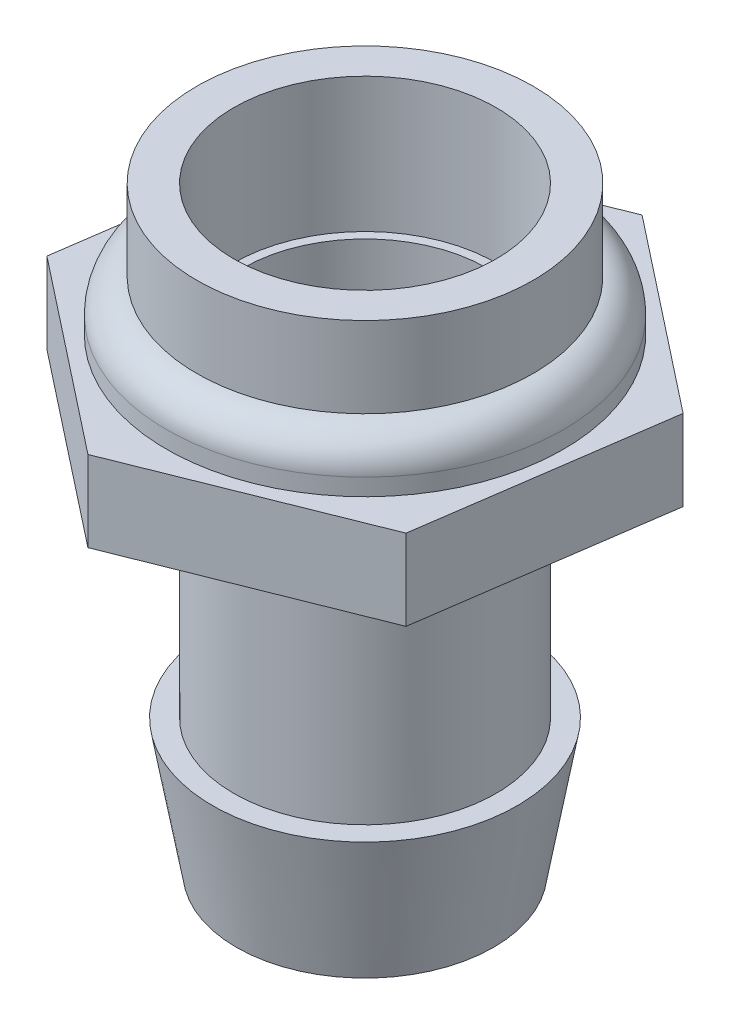
ISO-10303-21;
HEADER;
FILE_DESCRIPTION(('STEP AP214'),'2;1');
FILE_NAME('part.step','',(''),(''),'','','');
FILE_SCHEMA(('AUTOMOTIVE_DESIGN { 1 0 10303 214 1 1 1 1 }'));
ENDSEC;
DATA;
#1=APPLICATION_CONTEXT('core data for automotive mechanical design processes');
#2=APPLICATION_PROTOCOL_DEFINITION('international standard','automotive_design',2000,#1);
#3=PRODUCT_CONTEXT('',#1,'mechanical');
#4=PRODUCT('Part','Part','',(#3));
#5=PRODUCT_RELATED_PRODUCT_CATEGORY('part','',(#4));
#6=PRODUCT_DEFINITION_FORMATION('','',#4);
#7=PRODUCT_DEFINITION_CONTEXT('part definition',#1,'design');
#8=PRODUCT_DEFINITION('design','',#6,#7);
#9=PRODUCT_DEFINITION_SHAPE('','',#8);
#10=(LENGTH_UNIT() NAMED_UNIT(*) SI_UNIT(.MILLI.,.METRE.));
#11=(NAMED_UNIT(*) PLANE_ANGLE_UNIT() SI_UNIT($,.RADIAN.));
#12=(NAMED_UNIT(*) SI_UNIT($,.STERADIAN.) SOLID_ANGLE_UNIT());
#13=UNCERTAINTY_MEASURE_WITH_UNIT(LENGTH_MEASURE(1.E-05),#10,'distance_accuracy_value','');
#14=(GEOMETRIC_REPRESENTATION_CONTEXT(3) GLOBAL_UNCERTAINTY_ASSIGNED_CONTEXT((#13)) GLOBAL_UNIT_ASSIGNED_CONTEXT((#10,
#11,#12)) REPRESENTATION_CONTEXT('',''));
#15=CARTESIAN_POINT('',(0.,0.,0.));
#16=DIRECTION('',(0.,0.,1.));
#17=DIRECTION('',(1.,0.,0.));
#18=AXIS2_PLACEMENT_3D('',#15,#16,#17);
#19=CARTESIAN_POINT('',(-38.0150992469953,8.001,-9.73674048361836));
#20=DIRECTION('',(0.,-1.,0.));
#21=DIRECTION('',(0.,0.,-1.));
#22=AXIS2_PLACEMENT_3D('',#19,#20,#21);
#23=CYLINDRICAL_SURFACE('',#22,4.6101);
#24=CARTESIAN_POINT('',(-38.0150992469953,-14.5542,-9.73674048361836));
#25=DIRECTION('',(0.,-1.,0.));
#26=DIRECTION('',(0.,0.,-1.));
#27=AXIS2_PLACEMENT_3D('',#24,#25,#26);
#28=CIRCLE('',#27,4.6101);
#29=CARTESIAN_POINT('',(-38.0150992469953,-14.5542,-14.3468404836184));
#30=VERTEX_POINT('',#29);
#31=EDGE_CURVE('E397',#30,#30,#28,.T.);
#32=ORIENTED_EDGE('',*,*,#31,.T.);
#33=EDGE_LOOP('',(#32));
#34=FACE_BOUND('',#33,.T.);
#35=CARTESIAN_POINT('',(-38.0150992469953,2.921,-9.73674048361836));
#36=DIRECTION('',(0.,1.,0.));
#37=DIRECTION('',(0.,0.,1.));
#38=AXIS2_PLACEMENT_3D('',#35,#36,#37);
#39=CIRCLE('',#38,4.6101);
#40=CARTESIAN_POINT('',(-38.0150992469953,2.921,-5.12664048361836));
#41=VERTEX_POINT('',#40);
#42=EDGE_CURVE('E40',#41,#41,#39,.F.);
#43=ORIENTED_EDGE('',*,*,#42,.F.);
#44=EDGE_LOOP('',(#43));
#45=FACE_BOUND('',#44,.T.);
#46=ADVANCED_FACE('F36',(#34,#45),#23,.F.);
#47=CARTESIAN_POINT('',(-39.3313691840741,3.048,-0.592228388774663));
#48=DIRECTION('',(-0.371514490296866,0.,-0.92842715573138));
#49=DIRECTION('',(-0.92842715573138,0.,0.371514490296866));
#50=AXIS2_PLACEMENT_3D('',#47,#48,#49);
#51=PLANE('',#50);
#52=DIRECTION('',(0.92842715573138,0.,-0.371514490296866));
#53=VECTOR('',#52,1.);
#54=CARTESIAN_POINT('',(-39.3313691840741,0.,-0.592228388774663));
#55=LINE('',#54,#53);
#56=CARTESIAN_POINT('',(-39.3313691840741,0.,-0.592228388774663));
#57=VERTEX_POINT('',#56);
#58=CARTESIAN_POINT('',(-30.753854436186,0.,-4.02456123244849));
#59=VERTEX_POINT('',#58);
#60=EDGE_CURVE('E123',#57,#59,#55,.T.);
#61=ORIENTED_EDGE('',*,*,#60,.T.);
#62=DIRECTION('',(0.,-1.,0.));
#63=VECTOR('',#62,1.);
#64=CARTESIAN_POINT('',(-30.753854436186,3.048,-4.02456123244849));
#65=LINE('',#64,#63);
#66=CARTESIAN_POINT('',(-30.753854436186,3.048,-4.02456123244849));
#67=VERTEX_POINT('',#66);
#68=EDGE_CURVE('E141',#67,#59,#65,.T.);
#69=ORIENTED_EDGE('',*,*,#68,.F.);
#70=DIRECTION('',(0.92842715573138,0.,-0.371514490296866));
#71=VECTOR('',#70,1.);
#72=CARTESIAN_POINT('',(-39.3313691840741,3.048,-0.592228388774663));
#73=LINE('',#72,#71);
#74=CARTESIAN_POINT('',(-39.3313691840741,3.048,-0.592228388774663));
#75=VERTEX_POINT('',#74);
#76=EDGE_CURVE('E134',#75,#67,#73,.T.);
#77=ORIENTED_EDGE('',*,*,#76,.F.);
#78=DIRECTION('',(0.,-1.,0.));
#79=VECTOR('',#78,1.);
#80=CARTESIAN_POINT('',(-39.3313691840741,3.048,-0.592228388774663));
#81=LINE('',#80,#79);
#82=EDGE_CURVE('E119',#75,#57,#81,.T.);
#83=ORIENTED_EDGE('',*,*,#82,.T.);
#84=EDGE_LOOP('',(#61,#69,#77,#83));
#85=FACE_BOUND('',#84,.T.);
#86=ADVANCED_FACE('F157',(#85),#51,.F.);
#87=CARTESIAN_POINT('',(-30.753854436186,3.048,-4.02456123244849));
#88=DIRECTION('',(-0.989798747575139,0.,-0.142472591394578));
#89=DIRECTION('',(-0.142472591394578,0.,0.989798747575139));
#90=AXIS2_PLACEMENT_3D('',#87,#88,#89);
#91=PLANE('',#90);
#92=DIRECTION('',(0.142472591394578,0.,-0.989798747575139));
#93=VECTOR('',#92,1.);
#94=CARTESIAN_POINT('',(-30.753854436186,0.,-4.02456123244849));
#95=LINE('',#94,#93);
#96=CARTESIAN_POINT('',(-29.4375844991072,0.,-13.1690733272922));
#97=VERTEX_POINT('',#96);
#98=EDGE_CURVE('E126',#59,#97,#95,.T.);
#99=ORIENTED_EDGE('',*,*,#98,.T.);
#100=DIRECTION('',(0.,-1.,0.));
#101=VECTOR('',#100,1.);
#102=CARTESIAN_POINT('',(-29.4375844991072,3.048,-13.1690733272922));
#103=LINE('',#102,#101);
#104=CARTESIAN_POINT('',(-29.4375844991072,3.048,-13.1690733272922));
#105=VERTEX_POINT('',#104);
#106=EDGE_CURVE('E138',#105,#97,#103,.T.);
#107=ORIENTED_EDGE('',*,*,#106,.F.);
#108=DIRECTION('',(0.142472591394578,0.,-0.989798747575139));
#109=VECTOR('',#108,1.);
#110=CARTESIAN_POINT('',(-30.753854436186,3.048,-4.02456123244849));
#111=LINE('',#110,#109);
#112=EDGE_CURVE('E92',#67,#105,#111,.T.);
#113=ORIENTED_EDGE('',*,*,#112,.F.);
#114=ORIENTED_EDGE('',*,*,#68,.T.);
#115=EDGE_LOOP('',(#99,#107,#113,#114));
#116=FACE_BOUND('',#115,.T.);
#117=ADVANCED_FACE('F175',(#116),#91,.F.);
#118=CARTESIAN_POINT('',(-29.4375844991072,3.048,-13.1690733272922));
#119=DIRECTION('',(-0.618284257278274,0.,0.785954564336803));
#120=DIRECTION('',(0.785954564336803,0.,0.618284257278274));
#121=AXIS2_PLACEMENT_3D('',#118,#119,#120);
#122=PLANE('',#121);
#123=DIRECTION('',(-0.785954564336803,0.,-0.618284257278274));
#124=VECTOR('',#123,1.);
#125=CARTESIAN_POINT('',(-29.4375844991072,0.,-13.1690733272922));
#126=LINE('',#125,#124);
#127=CARTESIAN_POINT('',(-36.6988293099165,0.,-18.881252578462));
#128=VERTEX_POINT('',#127);
#129=EDGE_CURVE('E129',#97,#128,#126,.T.);
#130=ORIENTED_EDGE('',*,*,#129,.T.);
#131=DIRECTION('',(0.,-1.,0.));
#132=VECTOR('',#131,1.);
#133=CARTESIAN_POINT('',(-36.6988293099165,3.048,-18.881252578462));
#134=LINE('',#133,#132);
#135=CARTESIAN_POINT('',(-36.6988293099165,3.048,-18.881252578462));
#136=VERTEX_POINT('',#135);
#137=EDGE_CURVE('E114',#136,#128,#134,.T.);
#138=ORIENTED_EDGE('',*,*,#137,.F.);
#139=DIRECTION('',(-0.785954564336803,0.,-0.618284257278274));
#140=VECTOR('',#139,1.);
#141=CARTESIAN_POINT('',(-29.4375844991072,3.048,-13.1690733272922));
#142=LINE('',#141,#140);
#143=EDGE_CURVE('E105',#105,#136,#142,.T.);
#144=ORIENTED_EDGE('',*,*,#143,.F.);
#145=ORIENTED_EDGE('',*,*,#106,.T.);
#146=EDGE_LOOP('',(#130,#138,#144,#145));
#147=FACE_BOUND('',#146,.T.);
#148=ADVANCED_FACE('F222',(#147),#122,.F.);
#149=CARTESIAN_POINT('',(-36.6988293099165,3.048,-18.881252578462));
#150=DIRECTION('',(0.371514490296865,0.,0.92842715573138));
#151=DIRECTION('',(0.92842715573138,0.,-0.371514490296866));
#152=AXIS2_PLACEMENT_3D('',#149,#150,#151);
#153=PLANE('',#152);
#154=DIRECTION('',(-0.92842715573138,0.,0.371514490296865));
#155=VECTOR('',#154,1.);
#156=CARTESIAN_POINT('',(-36.6988293099165,0.,-18.881252578462));
#157=LINE('',#156,#155);
#158=CARTESIAN_POINT('',(-45.2763440578046,0.,-15.4489197347882));
#159=VERTEX_POINT('',#158);
#160=EDGE_CURVE('E113',#128,#159,#157,.T.);
#161=ORIENTED_EDGE('',*,*,#160,.T.);
#162=DIRECTION('',(0.,-1.,0.));
#163=VECTOR('',#162,1.);
#164=CARTESIAN_POINT('',(-45.2763440578046,3.048,-15.4489197347882));
#165=LINE('',#164,#163);
#166=CARTESIAN_POINT('',(-45.2763440578046,3.048,-15.4489197347882));
#167=VERTEX_POINT('',#166);
#168=EDGE_CURVE('E110',#167,#159,#165,.T.);
#169=ORIENTED_EDGE('',*,*,#168,.F.);
#170=DIRECTION('',(-0.92842715573138,0.,0.371514490296865));
#171=VECTOR('',#170,1.);
#172=CARTESIAN_POINT('',(-36.6988293099165,3.048,-18.881252578462));
#173=LINE('',#172,#171);
#174=EDGE_CURVE('E99',#136,#167,#173,.T.);
#175=ORIENTED_EDGE('',*,*,#174,.F.);
#176=ORIENTED_EDGE('',*,*,#137,.T.);
#177=EDGE_LOOP('',(#161,#169,#175,#176));
#178=FACE_BOUND('',#177,.T.);
#179=ADVANCED_FACE('F111',(#178),#153,.F.);
#180=CARTESIAN_POINT('',(-45.2763440578046,3.048,-15.4489197347882));
#181=DIRECTION('',(0.989798747575139,0.,0.142472591394577));
#182=DIRECTION('',(0.142472591394577,0.,-0.989798747575139));
#183=AXIS2_PLACEMENT_3D('',#180,#181,#182);
#184=PLANE('',#183);
#185=DIRECTION('',(-0.142472591394577,0.,0.989798747575139));
#186=VECTOR('',#185,1.);
#187=CARTESIAN_POINT('',(-45.2763440578046,0.,-15.4489197347882));
#188=LINE('',#187,#186);
#189=CARTESIAN_POINT('',(-46.5926139948834,0.,-6.30440763994452));
#190=VERTEX_POINT('',#189);
#191=EDGE_CURVE('E77',#159,#190,#188,.T.);
#192=ORIENTED_EDGE('',*,*,#191,.T.);
#193=DIRECTION('',(0.,-1.,0.));
#194=VECTOR('',#193,1.);
#195=CARTESIAN_POINT('',(-46.5926139948834,3.048,-6.30440763994452));
#196=LINE('',#195,#194);
#197=CARTESIAN_POINT('',(-46.5926139948834,3.048,-6.30440763994452));
#198=VERTEX_POINT('',#197);
#199=EDGE_CURVE('E115',#198,#190,#196,.T.);
#200=ORIENTED_EDGE('',*,*,#199,.F.);
#201=DIRECTION('',(-0.142472591394577,0.,0.989798747575139));
#202=VECTOR('',#201,1.);
#203=CARTESIAN_POINT('',(-45.2763440578046,3.048,-15.4489197347882));
#204=LINE('',#203,#202);
#205=EDGE_CURVE('E103',#167,#198,#204,.T.);
#206=ORIENTED_EDGE('',*,*,#205,.F.);
#207=ORIENTED_EDGE('',*,*,#168,.T.);
#208=EDGE_LOOP('',(#192,#200,#206,#207));
#209=FACE_BOUND('',#208,.T.);
#210=ADVANCED_FACE('F117',(#209),#184,.F.);
#211=CARTESIAN_POINT('',(-46.5926139948834,3.048,-6.30440763994452));
#212=DIRECTION('',(0.618284257278274,0.,-0.785954564336802));
#213=DIRECTION('',(-0.785954564336802,0.,-0.618284257278274));
#214=AXIS2_PLACEMENT_3D('',#211,#212,#213);
#215=PLANE('',#214);
#216=DIRECTION('',(0.785954564336802,0.,0.618284257278274));
#217=VECTOR('',#216,1.);
#218=CARTESIAN_POINT('',(-46.5926139948834,0.,-6.30440763994452));
#219=LINE('',#218,#217);
#220=EDGE_CURVE('E83',#190,#57,#219,.T.);
#221=ORIENTED_EDGE('',*,*,#220,.T.);
#222=ORIENTED_EDGE('',*,*,#82,.F.);
#223=DIRECTION('',(0.785954564336802,0.,0.618284257278274));
#224=VECTOR('',#223,1.);
#225=CARTESIAN_POINT('',(-46.5926139948834,3.048,-6.30440763994452));
#226=LINE('',#225,#224);
#227=EDGE_CURVE('E54',#198,#75,#226,.T.);
#228=ORIENTED_EDGE('',*,*,#227,.F.);
#229=ORIENTED_EDGE('',*,*,#199,.T.);
#230=EDGE_LOOP('',(#221,#222,#228,#229));
#231=FACE_BOUND('',#230,.T.);
#232=ADVANCED_FACE('F159',(#231),#215,.F.);
#233=CARTESIAN_POINT('',(0.,3.048,0.));
#234=DIRECTION('',(0.,1.,0.));
#235=DIRECTION('',(0.,0.,1.));
#236=AXIS2_PLACEMENT_3D('',#233,#234,#235);
#237=PLANE('',#236);
#238=CARTESIAN_POINT('',(-38.0150992469953,3.048,-9.73674048361835));
#239=DIRECTION('',(0.,1.,0.));
#240=DIRECTION('',(0.,0.,1.));
#241=AXIS2_PLACEMENT_3D('',#238,#239,#240);
#242=CIRCLE('',#241,7.493);
#243=CARTESIAN_POINT('',(-38.0150992469953,3.048,-17.2297404836184));
#244=VERTEX_POINT('',#243);
#245=EDGE_CURVE('E127',#244,#244,#242,.T.);
#246=ORIENTED_EDGE('',*,*,#245,.F.);
#247=EDGE_LOOP('',(#246));
#248=FACE_BOUND('',#247,.T.);
#249=ORIENTED_EDGE('',*,*,#76,.T.);
#250=ORIENTED_EDGE('',*,*,#112,.T.);
#251=ORIENTED_EDGE('',*,*,#143,.T.);
#252=ORIENTED_EDGE('',*,*,#174,.T.);
#253=ORIENTED_EDGE('',*,*,#205,.T.);
#254=ORIENTED_EDGE('',*,*,#227,.T.);
#255=EDGE_LOOP('',(#249,#250,#251,#252,#253,#254));
#256=FACE_BOUND('',#255,.T.);
#257=ADVANCED_FACE('F101',(#248,#256),#237,.T.);
#258=CARTESIAN_POINT('',(0.,0.,0.));
#259=DIRECTION('',(0.,1.,0.));
#260=DIRECTION('',(0.,0.,1.));
#261=AXIS2_PLACEMENT_3D('',#258,#259,#260);
#262=PLANE('',#261);
#263=CARTESIAN_POINT('',(-38.0150992469953,0.,-9.73674048361836));
#264=DIRECTION('',(0.,1.,0.));
#265=DIRECTION('',(0.,0.,1.));
#266=AXIS2_PLACEMENT_3D('',#263,#264,#265);
#267=CIRCLE('',#266,4.953);
#268=CARTESIAN_POINT('',(-38.0150992469953,0.,-4.78374048361836));
#269=VERTEX_POINT('',#268);
#270=EDGE_CURVE('E46',#269,#269,#267,.F.);
#271=ORIENTED_EDGE('',*,*,#270,.F.);
#272=EDGE_LOOP('',(#271));
#273=FACE_BOUND('',#272,.T.);
#274=ORIENTED_EDGE('',*,*,#60,.F.);
#275=ORIENTED_EDGE('',*,*,#220,.F.);
#276=ORIENTED_EDGE('',*,*,#191,.F.);
#277=ORIENTED_EDGE('',*,*,#160,.F.);
#278=ORIENTED_EDGE('',*,*,#129,.F.);
#279=ORIENTED_EDGE('',*,*,#98,.F.);
#280=EDGE_LOOP('',(#274,#275,#276,#277,#278,#279));
#281=FACE_BOUND('',#280,.T.);
#282=ADVANCED_FACE('F148',(#273,#281),#262,.F.);
#283=CARTESIAN_POINT('',(-38.0150992469953,4.953,-9.73674048361835));
#284=DIRECTION('',(0.,-1.,0.));
#285=DIRECTION('',(0.,0.,-1.));
#286=AXIS2_PLACEMENT_3D('',#283,#284,#285);
#287=CYLINDRICAL_SURFACE('',#286,7.493);
#288=CARTESIAN_POINT('',(-38.0150992469953,3.68936595487459,-9.73674048361835));
#289=DIRECTION('',(0.,1.,0.));
#290=DIRECTION('',(0.,0.,1.));
#291=AXIS2_PLACEMENT_3D('',#288,#289,#290);
#292=CIRCLE('',#291,7.493);
#293=CARTESIAN_POINT('',(-38.0150992469953,3.68936595487459,-17.2297404836184));
#294=VERTEX_POINT('',#293);
#295=EDGE_CURVE('E11',#294,#294,#292,.F.);
#296=CARTESIAN_POINT('',(-38.0150992469953,3.68936595487459,-17.2297404836184));
#297=CARTESIAN_POINT('',(-38.0150992469953,3.68268505951132,-17.2297404836184));
#298=CARTESIAN_POINT('',(-38.0150992469953,3.67600416414804,-17.2297404836184));
#299=CARTESIAN_POINT('',(-38.0150992469953,3.66264237342148,-17.2297404836184));
#300=CARTESIAN_POINT('',(-38.0150992469953,3.65596147805821,-17.2297404836184));
#301=CARTESIAN_POINT('',(-38.0150992469953,3.64259968733165,-17.2297404836184));
#302=CARTESIAN_POINT('',(-38.0150992469953,3.63591879196838,-17.2297404836184));
#303=CARTESIAN_POINT('',(-38.0150992469953,3.62255700124182,-17.2297404836184));
#304=CARTESIAN_POINT('',(-38.0150992469953,3.61587610587855,-17.2297404836184));
#305=CARTESIAN_POINT('',(-38.0150992469953,3.60251431515199,-17.2297404836184));
#306=CARTESIAN_POINT('',(-38.0150992469953,3.59583341978871,-17.2297404836184));
#307=CARTESIAN_POINT('',(-38.0150992469953,3.58247162906216,-17.2297404836184));
#308=CARTESIAN_POINT('',(-38.0150992469953,3.57579073369888,-17.2297404836184));
#309=CARTESIAN_POINT('',(-38.0150992469953,3.56242894297233,-17.2297404836184));
#310=CARTESIAN_POINT('',(-38.0150992469953,3.55574804760905,-17.2297404836184));
#311=CARTESIAN_POINT('',(-38.0150992469953,3.5423862568825,-17.2297404836184));
#312=CARTESIAN_POINT('',(-38.0150992469953,3.53570536151922,-17.2297404836184));
#313=CARTESIAN_POINT('',(-38.0150992469953,3.52234357079267,-17.2297404836184));
#314=CARTESIAN_POINT('',(-38.0150992469953,3.51566267542939,-17.2297404836184));
#315=CARTESIAN_POINT('',(-38.0150992469953,3.50230088470284,-17.2297404836184));
#316=CARTESIAN_POINT('',(-38.0150992469953,3.49561998933956,-17.2297404836184));
#317=CARTESIAN_POINT('',(-38.0150992469953,3.48225819861301,-17.2297404836184));
#318=CARTESIAN_POINT('',(-38.0150992469953,3.47557730324973,-17.2297404836184));
#319=CARTESIAN_POINT('',(-38.0150992469953,3.46221551252317,-17.2297404836184));
#320=CARTESIAN_POINT('',(-38.0150992469953,3.4555346171599,-17.2297404836184));
#321=CARTESIAN_POINT('',(-38.0150992469953,3.44217282643334,-17.2297404836184));
#322=CARTESIAN_POINT('',(-38.0150992469953,3.43549193107007,-17.2297404836184));
#323=CARTESIAN_POINT('',(-38.0150992469953,3.42213014034351,-17.2297404836184));
#324=CARTESIAN_POINT('',(-38.0150992469953,3.41544924498024,-17.2297404836184));
#325=CARTESIAN_POINT('',(-38.0150992469953,3.40208745425368,-17.2297404836184));
#326=CARTESIAN_POINT('',(-38.0150992469953,3.3954065588904,-17.2297404836184));
#327=CARTESIAN_POINT('',(-38.0150992469953,3.38204476816385,-17.2297404836184));
#328=CARTESIAN_POINT('',(-38.0150992469953,3.37536387280057,-17.2297404836184));
#329=CARTESIAN_POINT('',(-38.0150992469953,3.36200208207402,-17.2297404836184));
#330=CARTESIAN_POINT('',(-38.0150992469953,3.35532118671074,-17.2297404836184));
#331=CARTESIAN_POINT('',(-38.0150992469953,3.34195939598419,-17.2297404836184));
#332=CARTESIAN_POINT('',(-38.0150992469953,3.33527850062091,-17.2297404836184));
#333=CARTESIAN_POINT('',(-38.0150992469953,3.32191670989436,-17.2297404836184));
#334=CARTESIAN_POINT('',(-38.0150992469953,3.31523581453108,-17.2297404836184));
#335=CARTESIAN_POINT('',(-38.0150992469953,3.30187402380453,-17.2297404836184));
#336=CARTESIAN_POINT('',(-38.0150992469953,3.29519312844125,-17.2297404836184));
#337=CARTESIAN_POINT('',(-38.0150992469953,3.28183133771469,-17.2297404836184));
#338=CARTESIAN_POINT('',(-38.0150992469953,3.27515044235142,-17.2297404836184));
#339=CARTESIAN_POINT('',(-38.0150992469953,3.26178865162486,-17.2297404836184));
#340=CARTESIAN_POINT('',(-38.0150992469953,3.25510775626159,-17.2297404836184));
#341=CARTESIAN_POINT('',(-38.0150992469953,3.24174596553503,-17.2297404836184));
#342=CARTESIAN_POINT('',(-38.0150992469953,3.23506507017176,-17.2297404836184));
#343=CARTESIAN_POINT('',(-38.0150992469953,3.2217032794452,-17.2297404836184));
#344=CARTESIAN_POINT('',(-38.0150992469953,3.21502238408192,-17.2297404836184));
#345=CARTESIAN_POINT('',(-38.0150992469953,3.20166059335537,-17.2297404836184));
#346=CARTESIAN_POINT('',(-38.0150992469953,3.19497969799209,-17.2297404836184));
#347=CARTESIAN_POINT('',(-38.0150992469953,3.18161790726554,-17.2297404836184));
#348=CARTESIAN_POINT('',(-38.0150992469953,3.17493701190226,-17.2297404836184));
#349=CARTESIAN_POINT('',(-38.0150992469953,3.16157522117571,-17.2297404836184));
#350=CARTESIAN_POINT('',(-38.0150992469953,3.15489432581243,-17.2297404836184));
#351=CARTESIAN_POINT('',(-38.0150992469953,3.14153253508588,-17.2297404836184));
#352=CARTESIAN_POINT('',(-38.0150992469953,3.1348516397226,-17.2297404836184));
#353=CARTESIAN_POINT('',(-38.0150992469953,3.12148984899605,-17.2297404836184));
#354=CARTESIAN_POINT('',(-38.0150992469953,3.11480895363277,-17.2297404836184));
#355=CARTESIAN_POINT('',(-38.0150992469953,3.10144716290622,-17.2297404836184));
#356=CARTESIAN_POINT('',(-38.0150992469953,3.09476626754294,-17.2297404836184));
#357=CARTESIAN_POINT('',(-38.0150992469953,3.08140447681638,-17.2297404836184));
#358=CARTESIAN_POINT('',(-38.0150992469953,3.07472358145311,-17.2297404836184));
#359=CARTESIAN_POINT('',(-38.0150992469953,3.06136179072655,-17.2297404836184));
#360=CARTESIAN_POINT('',(-38.0150992469953,3.05468089536328,-17.2297404836184));
#361=CARTESIAN_POINT('',(-38.0150992469953,3.048,-17.2297404836184));
#362=B_SPLINE_CURVE_WITH_KNOTS('',3,(#296,#297,#298,#299,#300,#301,#302,#303,#304,#305,#306,
#307,#308,#309,#310,#311,#312,#313,#314,#315,#316,#317,#318,#319,#320,#321,#322,#323,#324,#325,
#326,#327,#328,#329,#330,#331,#332,#333,#334,#335,#336,#337,#338,#339,#340,#341,#342,#343,#344,
#345,#346,#347,#348,#349,#350,#351,#352,#353,#354,#355,#356,#357,#358,#359,#360,#361),
.UNSPECIFIED.,.F.,.F.,(4,2,2,2,2,2,2,2,2,2,2,2,2,2,2,2,2,2,2,2,2,2,2,2,2,2,2,2,2,2,2,2,4),(0.,
0.0200426860898313,0.0400853721796626,0.060128058269493,0.0801707443593243,0.100213430449156,
0.120256116538986,0.140298802628817,0.160341488718649,0.180384174808479,0.20042686089831,
0.220469546988141,0.240512233077973,0.260554919167803,0.280597605257634,0.300640291347466,
0.320682977437297,0.340725663527127,0.360768349616959,0.38081103570679,0.40085372179662,
0.420896407886452,0.440939093976283,0.460981780066114,0.481024466155945,0.501067152245776,
0.521109838335607,0.541152524425438,0.561195210515269,0.5812378966051,0.601280582694931,
0.621323268784762,0.641365954874593),.UNSPECIFIED.);
#363=EDGE_CURVE('BSEAM151',#294,#244,#362,.T.);
#364=ORIENTED_EDGE('',*,*,#295,.T.);
#365=ORIENTED_EDGE('',*,*,#245,.T.);
#366=ORIENTED_EDGE('',*,*,#363,.T.);
#367=ORIENTED_EDGE('',*,*,#363,.F.);
#368=EDGE_LOOP('',(#364,#366,#365,#367));
#369=FACE_BOUND('',#368,.T.);
#370=ADVANCED_FACE('F151',(#369),#287,.T.);
#371=CARTESIAN_POINT('',(-38.0150992469953,8.001,-9.73674048361835));
#372=DIRECTION('',(0.,-1.,0.));
#373=DIRECTION('',(0.,0.,-1.));
#374=AXIS2_PLACEMENT_3D('',#371,#372,#373);
#375=CYLINDRICAL_SURFACE('',#374,6.35);
#376=CARTESIAN_POINT('',(-38.0150992469953,8.001,-9.73674048361835));
#377=DIRECTION('',(0.,1.,0.));
#378=DIRECTION('',(0.,0.,1.));
#379=AXIS2_PLACEMENT_3D('',#376,#377,#378);
#380=CIRCLE('',#379,6.35);
#381=CARTESIAN_POINT('',(-38.0150992469953,8.001,-16.0867404836184));
#382=VERTEX_POINT('',#381);
#383=EDGE_CURVE('E213',#382,#382,#380,.T.);
#384=CARTESIAN_POINT('',(-38.0150992469953,4.953,-9.73674048361835));
#385=DIRECTION('',(0.,1.,0.));
#386=DIRECTION('',(0.,0.,1.));
#387=AXIS2_PLACEMENT_3D('',#384,#385,#386);
#388=CIRCLE('',#387,6.35);
#389=CARTESIAN_POINT('',(-38.0150992469953,4.953,-16.0867404836184));
#390=VERTEX_POINT('',#389);
#391=EDGE_CURVE('E216',#390,#390,#388,.T.);
#392=CARTESIAN_POINT('',(-38.0150992469953,8.001,-16.0867404836184));
#393=CARTESIAN_POINT('',(-38.0150992469953,7.96925,-16.0867404836184));
#394=CARTESIAN_POINT('',(-38.0150992469953,7.9375,-16.0867404836184));
#395=CARTESIAN_POINT('',(-38.0150992469953,7.874,-16.0867404836184));
#396=CARTESIAN_POINT('',(-38.0150992469953,7.84225,-16.0867404836184));
#397=CARTESIAN_POINT('',(-38.0150992469953,7.77875,-16.0867404836184));
#398=CARTESIAN_POINT('',(-38.0150992469953,7.747,-16.0867404836184));
#399=CARTESIAN_POINT('',(-38.0150992469953,7.6835,-16.0867404836184));
#400=CARTESIAN_POINT('',(-38.0150992469953,7.65175,-16.0867404836184));
#401=CARTESIAN_POINT('',(-38.0150992469953,7.58825,-16.0867404836184));
#402=CARTESIAN_POINT('',(-38.0150992469953,7.5565,-16.0867404836184));
#403=CARTESIAN_POINT('',(-38.0150992469953,7.493,-16.0867404836184));
#404=CARTESIAN_POINT('',(-38.0150992469953,7.46125,-16.0867404836184));
#405=CARTESIAN_POINT('',(-38.0150992469953,7.39775,-16.0867404836184));
#406=CARTESIAN_POINT('',(-38.0150992469953,7.366,-16.0867404836184));
#407=CARTESIAN_POINT('',(-38.0150992469953,7.3025,-16.0867404836184));
#408=CARTESIAN_POINT('',(-38.0150992469953,7.27075,-16.0867404836184));
#409=CARTESIAN_POINT('',(-38.0150992469953,7.20725,-16.0867404836184));
#410=CARTESIAN_POINT('',(-38.0150992469953,7.1755,-16.0867404836184));
#411=CARTESIAN_POINT('',(-38.0150992469953,7.112,-16.0867404836184));
#412=CARTESIAN_POINT('',(-38.0150992469953,7.08025,-16.0867404836184));
#413=CARTESIAN_POINT('',(-38.0150992469953,7.01675,-16.0867404836184));
#414=CARTESIAN_POINT('',(-38.0150992469953,6.985,-16.0867404836184));
#415=CARTESIAN_POINT('',(-38.0150992469953,6.9215,-16.0867404836184));
#416=CARTESIAN_POINT('',(-38.0150992469953,6.88975,-16.0867404836184));
#417=CARTESIAN_POINT('',(-38.0150992469953,6.82625,-16.0867404836184));
#418=CARTESIAN_POINT('',(-38.0150992469953,6.7945,-16.0867404836184));
#419=CARTESIAN_POINT('',(-38.0150992469953,6.731,-16.0867404836184));
#420=CARTESIAN_POINT('',(-38.0150992469953,6.69925,-16.0867404836184));
#421=CARTESIAN_POINT('',(-38.0150992469953,6.63575,-16.0867404836184));
#422=CARTESIAN_POINT('',(-38.0150992469953,6.604,-16.0867404836184));
#423=CARTESIAN_POINT('',(-38.0150992469953,6.5405,-16.0867404836184));
#424=CARTESIAN_POINT('',(-38.0150992469953,6.50875,-16.0867404836184));
#425=CARTESIAN_POINT('',(-38.0150992469953,6.44525,-16.0867404836184));
#426=CARTESIAN_POINT('',(-38.0150992469953,6.4135,-16.0867404836184));
#427=CARTESIAN_POINT('',(-38.0150992469953,6.35,-16.0867404836184));
#428=CARTESIAN_POINT('',(-38.0150992469953,6.31825,-16.0867404836184));
#429=CARTESIAN_POINT('',(-38.0150992469953,6.25475,-16.0867404836184));
#430=CARTESIAN_POINT('',(-38.0150992469953,6.223,-16.0867404836184));
#431=CARTESIAN_POINT('',(-38.0150992469953,6.1595,-16.0867404836184));
#432=CARTESIAN_POINT('',(-38.0150992469953,6.12775,-16.0867404836184));
#433=CARTESIAN_POINT('',(-38.0150992469953,6.06425,-16.0867404836184));
#434=CARTESIAN_POINT('',(-38.0150992469953,6.0325,-16.0867404836184));
#435=CARTESIAN_POINT('',(-38.0150992469953,5.969,-16.0867404836184));
#436=CARTESIAN_POINT('',(-38.0150992469953,5.93725,-16.0867404836184));
#437=CARTESIAN_POINT('',(-38.0150992469953,5.87375,-16.0867404836184));
#438=CARTESIAN_POINT('',(-38.0150992469953,5.842,-16.0867404836184));
#439=CARTESIAN_POINT('',(-38.0150992469953,5.7785,-16.0867404836184));
#440=CARTESIAN_POINT('',(-38.0150992469953,5.74675,-16.0867404836184));
#441=CARTESIAN_POINT('',(-38.0150992469953,5.68325,-16.0867404836184));
#442=CARTESIAN_POINT('',(-38.0150992469953,5.6515,-16.0867404836184));
#443=CARTESIAN_POINT('',(-38.0150992469953,5.588,-16.0867404836184));
#444=CARTESIAN_POINT('',(-38.0150992469953,5.55625,-16.0867404836184));
#445=CARTESIAN_POINT('',(-38.0150992469953,5.49275,-16.0867404836184));
#446=CARTESIAN_POINT('',(-38.0150992469953,5.461,-16.0867404836184));
#447=CARTESIAN_POINT('',(-38.0150992469953,5.3975,-16.0867404836184));
#448=CARTESIAN_POINT('',(-38.0150992469953,5.36575,-16.0867404836184));
#449=CARTESIAN_POINT('',(-38.0150992469953,5.30225,-16.0867404836184));
#450=CARTESIAN_POINT('',(-38.0150992469953,5.2705,-16.0867404836184));
#451=CARTESIAN_POINT('',(-38.0150992469953,5.207,-16.0867404836184));
#452=CARTESIAN_POINT('',(-38.0150992469953,5.17525,-16.0867404836184));
#453=CARTESIAN_POINT('',(-38.0150992469953,5.11175,-16.0867404836184));
#454=CARTESIAN_POINT('',(-38.0150992469953,5.08,-16.0867404836184));
#455=CARTESIAN_POINT('',(-38.0150992469953,5.0165,-16.0867404836184));
#456=CARTESIAN_POINT('',(-38.0150992469953,4.98475,-16.0867404836184));
#457=CARTESIAN_POINT('',(-38.0150992469953,4.953,-16.0867404836184));
#458=B_SPLINE_CURVE_WITH_KNOTS('',3,(#392,#393,#394,#395,#396,#397,#398,#399,#400,#401,#402,
#403,#404,#405,#406,#407,#408,#409,#410,#411,#412,#413,#414,#415,#416,#417,#418,#419,#420,#421,
#422,#423,#424,#425,#426,#427,#428,#429,#430,#431,#432,#433,#434,#435,#436,#437,#438,#439,#440,
#441,#442,#443,#444,#445,#446,#447,#448,#449,#450,#451,#452,#453,#454,#455,#456,#457),
.UNSPECIFIED.,.F.,.F.,(4,2,2,2,2,2,2,2,2,2,2,2,2,2,2,2,2,2,2,2,2,2,2,2,2,2,2,2,2,2,2,2,4),(0.,
0.0952500000000016,0.190500000000001,0.28575,0.381000000000001,0.476250000000001,
0.571500000000001,0.666750000000001,0.762000000000001,0.85725,0.9525,1.04775,1.143,1.23825,
1.3335,1.42875,1.524,1.61925,1.7145,1.80975,1.905,2.00025,2.0955,2.19075,2.286,2.38125,2.4765,
2.57175,2.667,2.76225,2.8575,2.95275,3.048),.UNSPECIFIED.);
#459=EDGE_CURVE('BSEAM200',#382,#390,#458,.T.);
#460=ORIENTED_EDGE('',*,*,#383,.F.);
#461=ORIENTED_EDGE('',*,*,#391,.T.);
#462=ORIENTED_EDGE('',*,*,#459,.T.);
#463=ORIENTED_EDGE('',*,*,#459,.F.);
#464=EDGE_LOOP('',(#460,#462,#461,#463));
#465=FACE_BOUND('',#464,.T.);
#466=ADVANCED_FACE('F200',(#465),#375,.T.);
#467=CARTESIAN_POINT('',(-38.0150992469953,8.001,-9.73674048361835));
#468=DIRECTION('',(0.,1.,0.));
#469=DIRECTION('',(0.,0.,1.));
#470=AXIS2_PLACEMENT_3D('',#467,#468,#469);
#471=PLANE('',#470);
#472=CARTESIAN_POINT('',(-38.0150992469953,8.001,-9.73674048361836));
#473=DIRECTION('',(0.,1.,0.));
#474=DIRECTION('',(0.,0.,1.));
#475=AXIS2_PLACEMENT_3D('',#472,#473,#474);
#476=CIRCLE('',#475,4.953);
#477=CARTESIAN_POINT('',(-38.0150992469953,8.001,-4.78374048361836));
#478=VERTEX_POINT('',#477);
#479=EDGE_CURVE('E399',#478,#478,#476,.T.);
#480=ORIENTED_EDGE('',*,*,#479,.F.);
#481=EDGE_LOOP('',(#480));
#482=FACE_BOUND('',#481,.T.);
#483=ORIENTED_EDGE('',*,*,#383,.T.);
#484=EDGE_LOOP('',(#483));
#485=FACE_BOUND('',#484,.T.);
#486=ADVANCED_FACE('F196',(#482,#485),#471,.T.);
#487=CARTESIAN_POINT('',(-38.0150992469953,-9.4742,-9.73674048361836));
#488=DIRECTION('',(0.,1.,0.));
#489=DIRECTION('',(0.,0.,1.));
#490=AXIS2_PLACEMENT_3D('',#487,#488,#489);
#491=CYLINDRICAL_SURFACE('',#490,4.953);
#492=CARTESIAN_POINT('',(-38.0150992469953,-9.4742,-9.73674048361836));
#493=DIRECTION('',(0.,-1.,0.));
#494=DIRECTION('',(0.,0.,-1.));
#495=AXIS2_PLACEMENT_3D('',#492,#493,#494);
#496=CIRCLE('',#495,4.953);
#497=CARTESIAN_POINT('',(-38.0150992469953,-9.4742,-14.6897404836184));
#498=VERTEX_POINT('',#497);
#499=EDGE_CURVE('E386',#498,#498,#496,.T.);
#500=ORIENTED_EDGE('',*,*,#499,.F.);
#501=EDGE_LOOP('',(#500));
#502=FACE_BOUND('',#501,.T.);
#503=ORIENTED_EDGE('',*,*,#270,.T.);
#504=EDGE_LOOP('',(#503));
#505=FACE_BOUND('',#504,.T.);
#506=ADVANCED_FACE('F146',(#502,#505),#491,.T.);
#507=CARTESIAN_POINT('',(-38.0150992469953,-9.4742,-9.73674048361836));
#508=DIRECTION('',(0.,1.,0.));
#509=DIRECTION('',(0.,0.,-1.));
#510=AXIS2_PLACEMENT_3D('',#507,#508,#509);
#511=CONICAL_SURFACE('',#510,5.7531,0.174532925199433);
#512=CARTESIAN_POINT('',(-38.0150992469953,-14.5542,-9.73674048361836));
#513=DIRECTION('',(0.,-1.,0.));
#514=DIRECTION('',(0.,0.,-1.));
#515=AXIS2_PLACEMENT_3D('',#512,#513,#514);
#516=CIRCLE('',#515,4.857358938001);
#517=CARTESIAN_POINT('',(-38.0150992469953,-14.5542,-14.5940994216194));
#518=VERTEX_POINT('',#517);
#519=EDGE_CURVE('E388',#518,#518,#516,.T.);
#520=ORIENTED_EDGE('',*,*,#519,.F.);
#521=EDGE_LOOP('',(#520));
#522=FACE_BOUND('',#521,.T.);
#523=CARTESIAN_POINT('',(-38.0150992469953,-9.4742,-9.73674048361836));
#524=DIRECTION('',(0.,-1.,0.));
#525=DIRECTION('',(0.,0.,-1.));
#526=AXIS2_PLACEMENT_3D('',#523,#524,#525);
#527=CIRCLE('',#526,5.7531);
#528=CARTESIAN_POINT('',(-38.0150992469953,-9.4742,-15.4898404836184));
#529=VERTEX_POINT('',#528);
#530=EDGE_CURVE('E392',#529,#529,#527,.T.);
#531=ORIENTED_EDGE('',*,*,#530,.T.);
#532=EDGE_LOOP('',(#531));
#533=FACE_BOUND('',#532,.T.);
#534=ADVANCED_FACE('F186',(#522,#533),#511,.T.);
#535=CARTESIAN_POINT('',(-38.0150992469953,-14.5542,-9.73674048361836));
#536=DIRECTION('',(0.,-1.,0.));
#537=DIRECTION('',(0.,0.,-1.));
#538=AXIS2_PLACEMENT_3D('',#535,#536,#537);
#539=PLANE('',#538);
#540=ORIENTED_EDGE('',*,*,#31,.F.);
#541=EDGE_LOOP('',(#540));
#542=FACE_BOUND('',#541,.T.);
#543=ORIENTED_EDGE('',*,*,#519,.T.);
#544=EDGE_LOOP('',(#543));
#545=FACE_BOUND('',#544,.T.);
#546=ADVANCED_FACE('F182',(#542,#545),#539,.T.);
#547=CARTESIAN_POINT('',(-38.0150992469953,-9.4742,-9.73674048361836));
#548=DIRECTION('',(0.,-1.,0.));
#549=DIRECTION('',(0.,0.,-1.));
#550=AXIS2_PLACEMENT_3D('',#547,#548,#549);
#551=PLANE('',#550);
#552=ORIENTED_EDGE('',*,*,#499,.T.);
#553=EDGE_LOOP('',(#552));
#554=FACE_BOUND('',#553,.T.);
#555=ORIENTED_EDGE('',*,*,#530,.F.);
#556=EDGE_LOOP('',(#555));
#557=FACE_BOUND('',#556,.T.);
#558=ADVANCED_FACE('F185',(#554,#557),#551,.F.);
#559=CARTESIAN_POINT('',(-38.0150992469953,3.68936595487459,-9.73674048361835));
#560=DIRECTION('',(0.,1.,0.));
#561=DIRECTION('',(0.,0.,1.));
#562=AXIS2_PLACEMENT_3D('',#559,#560,#561);
#563=TOROIDAL_SURFACE('',#562,6.223,1.27);
#564=ORIENTED_EDGE('',*,*,#295,.F.);
#565=EDGE_LOOP('',(#564));
#566=FACE_BOUND('',#565,.T.);
#567=ORIENTED_EDGE('',*,*,#391,.F.);
#568=EDGE_LOOP('',(#567));
#569=FACE_BOUND('',#568,.T.);
#570=ADVANCED_FACE('F38',(#566,#569),#563,.T.);
#571=CARTESIAN_POINT('',(-38.0150992469953,2.921,-9.73674048361836));
#572=DIRECTION('',(0.,1.,0.));
#573=DIRECTION('',(0.,0.,1.));
#574=AXIS2_PLACEMENT_3D('',#571,#572,#573);
#575=PLANE('',#574);
#576=CARTESIAN_POINT('',(-38.0150992469953,2.921,-9.73674048361836));
#577=DIRECTION('',(0.,1.,0.));
#578=DIRECTION('',(0.,0.,1.));
#579=AXIS2_PLACEMENT_3D('',#576,#577,#578);
#580=CIRCLE('',#579,4.953);
#581=CARTESIAN_POINT('',(-38.0150992469953,2.921,-4.78374048361836));
#582=VERTEX_POINT('',#581);
#583=EDGE_CURVE('E402',#582,#582,#580,.T.);
#584=ORIENTED_EDGE('',*,*,#583,.T.);
#585=EDGE_LOOP('',(#584));
#586=FACE_BOUND('',#585,.T.);
#587=ORIENTED_EDGE('',*,*,#42,.T.);
#588=EDGE_LOOP('',(#587));
#589=FACE_BOUND('',#588,.T.);
#590=ADVANCED_FACE('F266',(#586,#589),#575,.T.);
#591=CARTESIAN_POINT('',(-38.0150992469953,2.921,-9.73674048361836));
#592=DIRECTION('',(0.,1.,0.));
#593=DIRECTION('',(0.,0.,1.));
#594=AXIS2_PLACEMENT_3D('',#591,#592,#593);
#595=CYLINDRICAL_SURFACE('',#594,4.953);
#596=ORIENTED_EDGE('',*,*,#583,.F.);
#597=EDGE_LOOP('',(#596));
#598=FACE_BOUND('',#597,.T.);
#599=ORIENTED_EDGE('',*,*,#479,.T.);
#600=EDGE_LOOP('',(#599));
#601=FACE_BOUND('',#600,.T.);
#602=ADVANCED_FACE('F180',(#598,#601),#595,.F.);
#603=CLOSED_SHELL('',(#46,#86,#117,#148,#179,#210,#232,#257,#282,#370,#466,#486,#506,#534,#546,
#558,#570,#590,#602));
#604=MANIFOLD_SOLID_BREP('B2',#603);
#605=ADVANCED_BREP_SHAPE_REPRESENTATION('',(#18,#604),#14);
#606=SHAPE_DEFINITION_REPRESENTATION(#9,#605);
ENDSEC;
END-ISO-10303-21;
